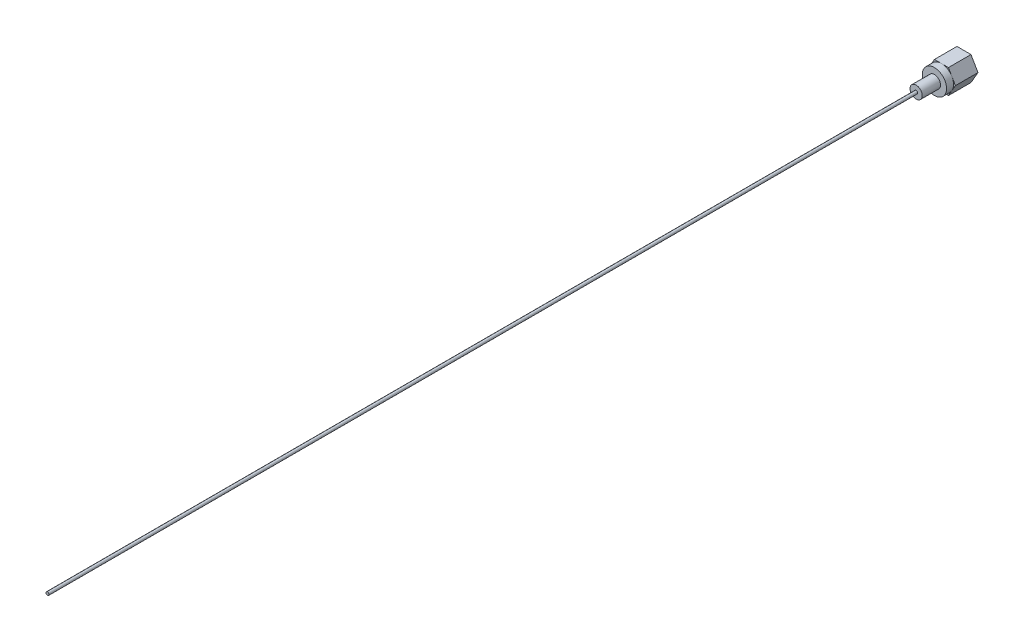
ISO-10303-21;
HEADER;
FILE_DESCRIPTION(('STEP AP214'),'2;1');
FILE_NAME('part.step','',(''),(''),'','','');
FILE_SCHEMA(('AUTOMOTIVE_DESIGN { 1 0 10303 214 1 1 1 1 }'));
ENDSEC;
DATA;
#1=APPLICATION_CONTEXT('core data for automotive mechanical design processes');
#2=APPLICATION_PROTOCOL_DEFINITION('international standard','automotive_design',2000,#1);
#3=PRODUCT_CONTEXT('',#1,'mechanical');
#4=PRODUCT('Part','Part','',(#3));
#5=PRODUCT_RELATED_PRODUCT_CATEGORY('part','',(#4));
#6=PRODUCT_DEFINITION_FORMATION('','',#4);
#7=PRODUCT_DEFINITION_CONTEXT('part definition',#1,'design');
#8=PRODUCT_DEFINITION('design','',#6,#7);
#9=PRODUCT_DEFINITION_SHAPE('','',#8);
#10=(LENGTH_UNIT() NAMED_UNIT(*) SI_UNIT(.MILLI.,.METRE.));
#11=(NAMED_UNIT(*) PLANE_ANGLE_UNIT() SI_UNIT($,.RADIAN.));
#12=(NAMED_UNIT(*) SI_UNIT($,.STERADIAN.) SOLID_ANGLE_UNIT());
#13=UNCERTAINTY_MEASURE_WITH_UNIT(LENGTH_MEASURE(1.E-05),#10,'distance_accuracy_value','');
#14=(GEOMETRIC_REPRESENTATION_CONTEXT(3) GLOBAL_UNCERTAINTY_ASSIGNED_CONTEXT((#13)) GLOBAL_UNIT_ASSIGNED_CONTEXT((#10,
#11,#12)) REPRESENTATION_CONTEXT('',''));
#15=CARTESIAN_POINT('',(0.,0.,0.));
#16=DIRECTION('',(0.,0.,1.));
#17=DIRECTION('',(1.,0.,0.));
#18=AXIS2_PLACEMENT_3D('',#15,#16,#17);
#19=CARTESIAN_POINT('',(0.,0.,7.4));
#20=DIRECTION('',(0.,0.,1.));
#21=DIRECTION('',(1.,0.,0.));
#22=AXIS2_PLACEMENT_3D('',#19,#20,#21);
#23=PLANE('',#22);
#24=CARTESIAN_POINT('',(0.,0.,7.4));
#25=DIRECTION('',(0.,0.,1.));
#26=DIRECTION('',(1.,0.,0.));
#27=AXIS2_PLACEMENT_3D('',#24,#25,#26);
#28=CIRCLE('',#27,3.98371685740842);
#29=CARTESIAN_POINT('',(3.45,1.9918584287042,7.4));
#30=VERTEX_POINT('',#29);
#31=CARTESIAN_POINT('',(0.,3.98371685740842,7.4));
#32=VERTEX_POINT('',#31);
#33=EDGE_CURVE('E136',#30,#32,#28,.T.);
#34=ORIENTED_EDGE('',*,*,#33,.F.);
#35=DIRECTION('',(-0.499999999999998,0.86602540378444,0.));
#36=VECTOR('',#35,1.);
#37=CARTESIAN_POINT('',(4.6,0.,7.4));
#38=LINE('',#37,#36);
#39=CARTESIAN_POINT('',(2.30000000000001,3.98371685740841,7.4));
#40=VERTEX_POINT('',#39);
#41=EDGE_CURVE('E124',#30,#40,#38,.T.);
#42=ORIENTED_EDGE('',*,*,#41,.T.);
#43=DIRECTION('',(-1.,0.,0.));
#44=VECTOR('',#43,1.);
#45=CARTESIAN_POINT('',(2.30000000000001,3.98371685740841,7.4));
#46=LINE('',#45,#44);
#47=EDGE_CURVE('E137',#40,#32,#46,.T.);
#48=ORIENTED_EDGE('',*,*,#47,.T.);
#49=EDGE_LOOP('',(#34,#42,#48));
#50=FACE_BOUND('',#49,.T.);
#51=ADVANCED_FACE('F39',(#50),#23,.T.);
#52=CARTESIAN_POINT('',(-3.45,1.99185842870421,7.4));
#53=VERTEX_POINT('',#52);
#54=EDGE_CURVE('E143',#32,#53,#28,.T.);
#55=ORIENTED_EDGE('',*,*,#54,.F.);
#56=CARTESIAN_POINT('',(-2.29999999999999,3.98371685740842,7.4));
#57=VERTEX_POINT('',#56);
#58=EDGE_CURVE('E123',#32,#57,#46,.T.);
#59=ORIENTED_EDGE('',*,*,#58,.T.);
#60=DIRECTION('',(-0.500000000000001,-0.866025403784438,0.));
#61=VECTOR('',#60,1.);
#62=CARTESIAN_POINT('',(-2.29999999999999,3.98371685740842,7.4));
#63=LINE('',#62,#61);
#64=EDGE_CURVE('E159',#57,#53,#63,.T.);
#65=ORIENTED_EDGE('',*,*,#64,.T.);
#66=EDGE_LOOP('',(#55,#59,#65));
#67=FACE_BOUND('',#66,.T.);
#68=ADVANCED_FACE('F204',(#67),#23,.T.);
#69=CARTESIAN_POINT('',(-3.45,-1.9918584287042,7.4));
#70=VERTEX_POINT('',#69);
#71=EDGE_CURVE('E64',#53,#70,#28,.T.);
#72=ORIENTED_EDGE('',*,*,#71,.F.);
#73=CARTESIAN_POINT('',(-4.6,0.,7.4));
#74=VERTEX_POINT('',#73);
#75=EDGE_CURVE('E158',#53,#74,#63,.T.);
#76=ORIENTED_EDGE('',*,*,#75,.T.);
#77=DIRECTION('',(0.499999999999998,-0.86602540378444,0.));
#78=VECTOR('',#77,1.);
#79=CARTESIAN_POINT('',(-4.6,0.,7.4));
#80=LINE('',#79,#78);
#81=EDGE_CURVE('E163',#74,#70,#80,.T.);
#82=ORIENTED_EDGE('',*,*,#81,.T.);
#83=EDGE_LOOP('',(#72,#76,#82));
#84=FACE_BOUND('',#83,.T.);
#85=ADVANCED_FACE('F243',(#84),#23,.T.);
#86=CARTESIAN_POINT('',(0.,-3.98371685740842,7.4));
#87=VERTEX_POINT('',#86);
#88=EDGE_CURVE('E56',#70,#87,#28,.T.);
#89=ORIENTED_EDGE('',*,*,#88,.F.);
#90=CARTESIAN_POINT('',(-2.30000000000001,-3.98371685740841,7.4));
#91=VERTEX_POINT('',#90);
#92=EDGE_CURVE('E162',#70,#91,#80,.T.);
#93=ORIENTED_EDGE('',*,*,#92,.T.);
#94=DIRECTION('',(1.,0.,0.));
#95=VECTOR('',#94,1.);
#96=CARTESIAN_POINT('',(-2.30000000000001,-3.98371685740841,7.4));
#97=LINE('',#96,#95);
#98=EDGE_CURVE('E152',#91,#87,#97,.T.);
#99=ORIENTED_EDGE('',*,*,#98,.T.);
#100=EDGE_LOOP('',(#89,#93,#99));
#101=FACE_BOUND('',#100,.T.);
#102=ADVANCED_FACE('F256',(#101),#23,.T.);
#103=CARTESIAN_POINT('',(3.45,-1.99185842870421,7.4));
#104=VERTEX_POINT('',#103);
#105=EDGE_CURVE('E146',#87,#104,#28,.T.);
#106=ORIENTED_EDGE('',*,*,#105,.F.);
#107=CARTESIAN_POINT('',(2.29999999999999,-3.98371685740842,7.4));
#108=VERTEX_POINT('',#107);
#109=EDGE_CURVE('E154',#87,#108,#97,.T.);
#110=ORIENTED_EDGE('',*,*,#109,.T.);
#111=DIRECTION('',(0.500000000000001,0.866025403784438,0.));
#112=VECTOR('',#111,1.);
#113=CARTESIAN_POINT('',(2.29999999999999,-3.98371685740842,7.4));
#114=LINE('',#113,#112);
#115=EDGE_CURVE('E134',#108,#104,#114,.T.);
#116=ORIENTED_EDGE('',*,*,#115,.T.);
#117=EDGE_LOOP('',(#106,#110,#116));
#118=FACE_BOUND('',#117,.T.);
#119=ADVANCED_FACE('F248',(#118),#23,.T.);
#120=CARTESIAN_POINT('',(-2.30000000000001,-3.98371685740841,7.4));
#121=DIRECTION('',(0.,1.,0.));
#122=DIRECTION('',(-1.,0.,0.));
#123=AXIS2_PLACEMENT_3D('',#120,#121,#122);
#124=PLANE('',#123);
#125=DIRECTION('',(1.,0.,0.));
#126=VECTOR('',#125,1.);
#127=CARTESIAN_POINT('',(-2.30000000000001,-3.98371685740841,0.));
#128=LINE('',#127,#126);
#129=CARTESIAN_POINT('',(-2.30000000000001,-3.98371685740841,0.));
#130=VERTEX_POINT('',#129);
#131=CARTESIAN_POINT('',(2.29999999999999,-3.98371685740842,0.));
#132=VERTEX_POINT('',#131);
#133=EDGE_CURVE('E166',#130,#132,#128,.T.);
#134=ORIENTED_EDGE('',*,*,#133,.T.);
#135=DIRECTION('',(0.,0.,-1.));
#136=VECTOR('',#135,1.);
#137=CARTESIAN_POINT('',(2.29999999999999,-3.98371685740842,7.4));
#138=LINE('',#137,#136);
#139=EDGE_CURVE('E43',#108,#132,#138,.T.);
#140=ORIENTED_EDGE('',*,*,#139,.F.);
#141=ORIENTED_EDGE('',*,*,#109,.F.);
#142=ORIENTED_EDGE('',*,*,#98,.F.);
#143=DIRECTION('',(0.,0.,-1.));
#144=VECTOR('',#143,1.);
#145=CARTESIAN_POINT('',(-2.30000000000001,-3.98371685740841,7.4));
#146=LINE('',#145,#144);
#147=EDGE_CURVE('E165',#91,#130,#146,.T.);
#148=ORIENTED_EDGE('',*,*,#147,.T.);
#149=EDGE_LOOP('',(#134,#140,#141,#142,#148));
#150=FACE_BOUND('',#149,.T.);
#151=ADVANCED_FACE('F41',(#150),#124,.F.);
#152=CARTESIAN_POINT('',(2.29999999999999,-3.98371685740842,7.4));
#153=DIRECTION('',(-0.866025403784438,0.500000000000001,0.));
#154=DIRECTION('',(-0.500000000000001,-0.866025403784438,0.));
#155=AXIS2_PLACEMENT_3D('',#152,#153,#154);
#156=PLANE('',#155);
#157=DIRECTION('',(0.500000000000001,0.866025403784438,0.));
#158=VECTOR('',#157,1.);
#159=CARTESIAN_POINT('',(2.29999999999999,-3.98371685740842,0.));
#160=LINE('',#159,#158);
#161=CARTESIAN_POINT('',(4.6,0.,0.));
#162=VERTEX_POINT('',#161);
#163=EDGE_CURVE('E169',#132,#162,#160,.T.);
#164=ORIENTED_EDGE('',*,*,#163,.T.);
#165=DIRECTION('',(0.,0.,-1.));
#166=VECTOR('',#165,1.);
#167=CARTESIAN_POINT('',(4.6,0.,7.4));
#168=LINE('',#167,#166);
#169=CARTESIAN_POINT('',(4.6,0.,7.4));
#170=VERTEX_POINT('',#169);
#171=EDGE_CURVE('E148',#170,#162,#168,.T.);
#172=ORIENTED_EDGE('',*,*,#171,.F.);
#173=EDGE_CURVE('E119',#104,#170,#114,.T.);
#174=ORIENTED_EDGE('',*,*,#173,.F.);
#175=ORIENTED_EDGE('',*,*,#115,.F.);
#176=ORIENTED_EDGE('',*,*,#139,.T.);
#177=EDGE_LOOP('',(#164,#172,#174,#175,#176));
#178=FACE_BOUND('',#177,.T.);
#179=ADVANCED_FACE('F262',(#178),#156,.F.);
#180=CARTESIAN_POINT('',(4.6,0.,7.4));
#181=DIRECTION('',(-0.86602540378444,-0.499999999999998,0.));
#182=DIRECTION('',(0.499999999999998,-0.86602540378444,0.));
#183=AXIS2_PLACEMENT_3D('',#180,#181,#182);
#184=PLANE('',#183);
#185=DIRECTION('',(-0.499999999999998,0.86602540378444,0.));
#186=VECTOR('',#185,1.);
#187=CARTESIAN_POINT('',(4.6,0.,0.));
#188=LINE('',#187,#186);
#189=CARTESIAN_POINT('',(2.30000000000001,3.98371685740841,0.));
#190=VERTEX_POINT('',#189);
#191=EDGE_CURVE('E171',#162,#190,#188,.T.);
#192=ORIENTED_EDGE('',*,*,#191,.T.);
#193=DIRECTION('',(0.,0.,-1.));
#194=VECTOR('',#193,1.);
#195=CARTESIAN_POINT('',(2.30000000000001,3.98371685740841,7.4));
#196=LINE('',#195,#194);
#197=EDGE_CURVE('E130',#40,#190,#196,.T.);
#198=ORIENTED_EDGE('',*,*,#197,.F.);
#199=ORIENTED_EDGE('',*,*,#41,.F.);
#200=EDGE_CURVE('E113',#170,#30,#38,.T.);
#201=ORIENTED_EDGE('',*,*,#200,.F.);
#202=ORIENTED_EDGE('',*,*,#171,.T.);
#203=EDGE_LOOP('',(#192,#198,#199,#201,#202));
#204=FACE_BOUND('',#203,.T.);
#205=ADVANCED_FACE('F128',(#204),#184,.F.);
#206=CARTESIAN_POINT('',(2.30000000000001,3.98371685740841,7.4));
#207=DIRECTION('',(0.,-1.,0.));
#208=DIRECTION('',(1.,0.,0.));
#209=AXIS2_PLACEMENT_3D('',#206,#207,#208);
#210=PLANE('',#209);
#211=DIRECTION('',(-1.,0.,0.));
#212=VECTOR('',#211,1.);
#213=CARTESIAN_POINT('',(2.30000000000001,3.98371685740841,0.));
#214=LINE('',#213,#212);
#215=CARTESIAN_POINT('',(-2.29999999999999,3.98371685740842,0.));
#216=VERTEX_POINT('',#215);
#217=EDGE_CURVE('E173',#190,#216,#214,.T.);
#218=ORIENTED_EDGE('',*,*,#217,.T.);
#219=DIRECTION('',(0.,0.,-1.));
#220=VECTOR('',#219,1.);
#221=CARTESIAN_POINT('',(-2.29999999999999,3.98371685740842,7.4));
#222=LINE('',#221,#220);
#223=EDGE_CURVE('E184',#57,#216,#222,.T.);
#224=ORIENTED_EDGE('',*,*,#223,.F.);
#225=ORIENTED_EDGE('',*,*,#58,.F.);
#226=ORIENTED_EDGE('',*,*,#47,.F.);
#227=ORIENTED_EDGE('',*,*,#197,.T.);
#228=EDGE_LOOP('',(#218,#224,#225,#226,#227));
#229=FACE_BOUND('',#228,.T.);
#230=ADVANCED_FACE('F197',(#229),#210,.F.);
#231=CARTESIAN_POINT('',(-2.29999999999999,3.98371685740842,7.4));
#232=DIRECTION('',(0.866025403784438,-0.500000000000001,0.));
#233=DIRECTION('',(0.500000000000001,0.866025403784438,0.));
#234=AXIS2_PLACEMENT_3D('',#231,#232,#233);
#235=PLANE('',#234);
#236=DIRECTION('',(-0.500000000000001,-0.866025403784438,0.));
#237=VECTOR('',#236,1.);
#238=CARTESIAN_POINT('',(-2.29999999999999,3.98371685740842,0.));
#239=LINE('',#238,#237);
#240=CARTESIAN_POINT('',(-4.6,0.,0.));
#241=VERTEX_POINT('',#240);
#242=EDGE_CURVE('E175',#216,#241,#239,.T.);
#243=ORIENTED_EDGE('',*,*,#242,.T.);
#244=DIRECTION('',(0.,0.,-1.));
#245=VECTOR('',#244,1.);
#246=CARTESIAN_POINT('',(-4.6,0.,7.4));
#247=LINE('',#246,#245);
#248=EDGE_CURVE('E181',#74,#241,#247,.T.);
#249=ORIENTED_EDGE('',*,*,#248,.F.);
#250=ORIENTED_EDGE('',*,*,#75,.F.);
#251=ORIENTED_EDGE('',*,*,#64,.F.);
#252=ORIENTED_EDGE('',*,*,#223,.T.);
#253=EDGE_LOOP('',(#243,#249,#250,#251,#252));
#254=FACE_BOUND('',#253,.T.);
#255=ADVANCED_FACE('F201',(#254),#235,.F.);
#256=CARTESIAN_POINT('',(-4.6,0.,7.4));
#257=DIRECTION('',(0.86602540378444,0.499999999999998,0.));
#258=DIRECTION('',(-0.499999999999998,0.86602540378444,0.));
#259=AXIS2_PLACEMENT_3D('',#256,#257,#258);
#260=PLANE('',#259);
#261=DIRECTION('',(0.499999999999998,-0.86602540378444,0.));
#262=VECTOR('',#261,1.);
#263=CARTESIAN_POINT('',(-4.6,0.,0.));
#264=LINE('',#263,#262);
#265=EDGE_CURVE('E177',#241,#130,#264,.T.);
#266=ORIENTED_EDGE('',*,*,#265,.T.);
#267=ORIENTED_EDGE('',*,*,#147,.F.);
#268=ORIENTED_EDGE('',*,*,#92,.F.);
#269=ORIENTED_EDGE('',*,*,#81,.F.);
#270=ORIENTED_EDGE('',*,*,#248,.T.);
#271=EDGE_LOOP('',(#266,#267,#268,#269,#270));
#272=FACE_BOUND('',#271,.T.);
#273=ADVANCED_FACE('F247',(#272),#260,.F.);
#274=EDGE_CURVE('E117',#104,#30,#28,.T.);
#275=ORIENTED_EDGE('',*,*,#274,.F.);
#276=ORIENTED_EDGE('',*,*,#173,.T.);
#277=ORIENTED_EDGE('',*,*,#200,.T.);
#278=EDGE_LOOP('',(#275,#276,#277));
#279=FACE_BOUND('',#278,.T.);
#280=ADVANCED_FACE('F115',(#279),#23,.T.);
#281=CARTESIAN_POINT('',(0.,0.,0.));
#282=DIRECTION('',(0.,0.,1.));
#283=DIRECTION('',(1.,0.,0.));
#284=AXIS2_PLACEMENT_3D('',#281,#282,#283);
#285=PLANE('',#284);
#286=ORIENTED_EDGE('',*,*,#133,.F.);
#287=ORIENTED_EDGE('',*,*,#265,.F.);
#288=ORIENTED_EDGE('',*,*,#242,.F.);
#289=ORIENTED_EDGE('',*,*,#217,.F.);
#290=ORIENTED_EDGE('',*,*,#191,.F.);
#291=ORIENTED_EDGE('',*,*,#163,.F.);
#292=EDGE_LOOP('',(#286,#287,#288,#289,#290,#291));
#293=FACE_BOUND('',#292,.T.);
#294=ADVANCED_FACE('F192',(#293),#285,.F.);
#295=CARTESIAN_POINT('',(0.,0.,9.7));
#296=DIRECTION('',(0.,0.,-1.));
#297=DIRECTION('',(-1.,0.,0.));
#298=AXIS2_PLACEMENT_3D('',#295,#296,#297);
#299=CYLINDRICAL_SURFACE('',#298,3.98371685740842);
#300=CARTESIAN_POINT('',(0.,0.,9.7));
#301=DIRECTION('',(0.,0.,1.));
#302=DIRECTION('',(1.,0.,0.));
#303=AXIS2_PLACEMENT_3D('',#300,#301,#302);
#304=CIRCLE('',#303,3.98371685740842);
#305=CARTESIAN_POINT('',(3.98371685740842,0.,9.7));
#306=VERTEX_POINT('',#305);
#307=EDGE_CURVE('E140',#306,#306,#304,.T.);
#308=ORIENTED_EDGE('',*,*,#307,.F.);
#309=EDGE_LOOP('',(#308));
#310=FACE_BOUND('',#309,.T.);
#311=ORIENTED_EDGE('',*,*,#33,.T.);
#312=ORIENTED_EDGE('',*,*,#54,.T.);
#313=ORIENTED_EDGE('',*,*,#71,.T.);
#314=ORIENTED_EDGE('',*,*,#88,.T.);
#315=ORIENTED_EDGE('',*,*,#105,.T.);
#316=ORIENTED_EDGE('',*,*,#274,.T.);
#317=EDGE_LOOP('',(#311,#312,#313,#314,#315,#316));
#318=FACE_BOUND('',#317,.T.);
#319=ADVANCED_FACE('F145',(#310,#318),#299,.T.);
#320=CARTESIAN_POINT('',(0.,0.,9.7));
#321=DIRECTION('',(0.,0.,1.));
#322=DIRECTION('',(1.,0.,0.));
#323=AXIS2_PLACEMENT_3D('',#320,#321,#322);
#324=PLANE('',#323);
#325=CARTESIAN_POINT('',(0.,0.,9.7));
#326=DIRECTION('',(0.,0.,1.));
#327=DIRECTION('',(1.,0.,0.));
#328=AXIS2_PLACEMENT_3D('',#325,#326,#327);
#329=CIRCLE('',#328,2.);
#330=CARTESIAN_POINT('',(2.,0.,9.7));
#331=VERTEX_POINT('',#330);
#332=EDGE_CURVE('E48',#331,#331,#329,.T.);
#333=ORIENTED_EDGE('',*,*,#332,.F.);
#334=EDGE_LOOP('',(#333));
#335=FACE_BOUND('',#334,.T.);
#336=ORIENTED_EDGE('',*,*,#307,.T.);
#337=EDGE_LOOP('',(#336));
#338=FACE_BOUND('',#337,.T.);
#339=ADVANCED_FACE('F231',(#335,#338),#324,.T.);
#340=CARTESIAN_POINT('',(0.,0.,15.7));
#341=DIRECTION('',(0.,0.,-1.));
#342=DIRECTION('',(-1.,0.,0.));
#343=AXIS2_PLACEMENT_3D('',#340,#341,#342);
#344=CYLINDRICAL_SURFACE('',#343,2.);
#345=CARTESIAN_POINT('',(0.,0.,15.7));
#346=DIRECTION('',(0.,0.,1.));
#347=DIRECTION('',(1.,0.,0.));
#348=AXIS2_PLACEMENT_3D('',#345,#346,#347);
#349=CIRCLE('',#348,2.);
#350=CARTESIAN_POINT('',(2.,0.,15.7));
#351=VERTEX_POINT('',#350);
#352=EDGE_CURVE('E141',#351,#351,#349,.T.);
#353=ORIENTED_EDGE('',*,*,#352,.F.);
#354=EDGE_LOOP('',(#353));
#355=FACE_BOUND('',#354,.T.);
#356=ORIENTED_EDGE('',*,*,#332,.T.);
#357=EDGE_LOOP('',(#356));
#358=FACE_BOUND('',#357,.T.);
#359=ADVANCED_FACE('F226',(#355,#358),#344,.T.);
#360=CARTESIAN_POINT('',(0.,0.,15.7));
#361=DIRECTION('',(0.,0.,1.));
#362=DIRECTION('',(1.,0.,0.));
#363=AXIS2_PLACEMENT_3D('',#360,#361,#362);
#364=PLANE('',#363);
#365=CARTESIAN_POINT('',(0.,0.,15.7));
#366=DIRECTION('',(0.,0.,1.));
#367=DIRECTION('',(1.,0.,0.));
#368=AXIS2_PLACEMENT_3D('',#365,#366,#367);
#369=CIRCLE('',#368,0.5);
#370=CARTESIAN_POINT('',(0.5,0.,15.7));
#371=VERTEX_POINT('',#370);
#372=EDGE_CURVE('E11',#371,#371,#369,.T.);
#373=ORIENTED_EDGE('',*,*,#372,.F.);
#374=EDGE_LOOP('',(#373));
#375=FACE_BOUND('',#374,.T.);
#376=ORIENTED_EDGE('',*,*,#352,.T.);
#377=EDGE_LOOP('',(#376));
#378=FACE_BOUND('',#377,.T.);
#379=ADVANCED_FACE('F220',(#375,#378),#364,.T.);
#380=CARTESIAN_POINT('',(0.,0.,300.7));
#381=DIRECTION('',(0.,0.,-1.));
#382=DIRECTION('',(-1.,0.,0.));
#383=AXIS2_PLACEMENT_3D('',#380,#381,#382);
#384=CYLINDRICAL_SURFACE('',#383,0.5);
#385=CARTESIAN_POINT('',(0.,0.,300.7));
#386=DIRECTION('',(0.,0.,1.));
#387=DIRECTION('',(1.,0.,0.));
#388=AXIS2_PLACEMENT_3D('',#385,#386,#387);
#389=CIRCLE('',#388,0.5);
#390=CARTESIAN_POINT('',(0.5,0.,300.7));
#391=VERTEX_POINT('',#390);
#392=EDGE_CURVE('E210',#391,#391,#389,.T.);
#393=ORIENTED_EDGE('',*,*,#392,.F.);
#394=EDGE_LOOP('',(#393));
#395=FACE_BOUND('',#394,.T.);
#396=ORIENTED_EDGE('',*,*,#372,.T.);
#397=EDGE_LOOP('',(#396));
#398=FACE_BOUND('',#397,.T.);
#399=ADVANCED_FACE('F217',(#395,#398),#384,.T.);
#400=CARTESIAN_POINT('',(0.,0.,300.7));
#401=DIRECTION('',(0.,0.,1.));
#402=DIRECTION('',(1.,0.,0.));
#403=AXIS2_PLACEMENT_3D('',#400,#401,#402);
#404=PLANE('',#403);
#405=ORIENTED_EDGE('',*,*,#392,.T.);
#406=EDGE_LOOP('',(#405));
#407=FACE_BOUND('',#406,.T.);
#408=ADVANCED_FACE('F215',(#407),#404,.T.);
#409=CLOSED_SHELL('',(#51,#68,#85,#102,#119,#151,#179,#205,#230,#255,#273,#280,#294,#319,#339,
#359,#379,#399,#408));
#410=MANIFOLD_SOLID_BREP('B2',#409);
#411=ADVANCED_BREP_SHAPE_REPRESENTATION('',(#18,#410),#14);
#412=SHAPE_DEFINITION_REPRESENTATION(#9,#411);
ENDSEC;
END-ISO-10303-21;
